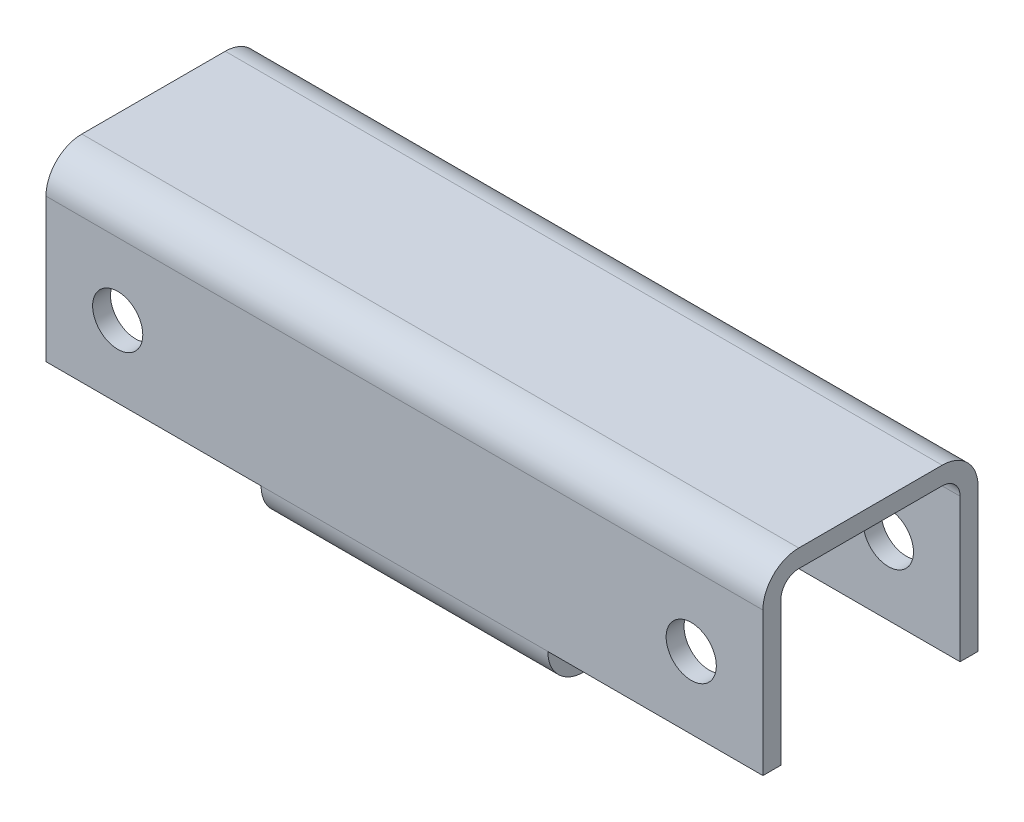
ISO-10303-21;
HEADER;
FILE_DESCRIPTION(('STEP AP214'),'2;1');
FILE_NAME('part.step','',(''),(''),'','','');
FILE_SCHEMA(('AUTOMOTIVE_DESIGN { 1 0 10303 214 1 1 1 1 }'));
ENDSEC;
DATA;
#1=APPLICATION_CONTEXT('core data for automotive mechanical design processes');
#2=APPLICATION_PROTOCOL_DEFINITION('international standard','automotive_design',2000,#1);
#3=PRODUCT_CONTEXT('',#1,'mechanical');
#4=PRODUCT('Part','Part','',(#3));
#5=PRODUCT_RELATED_PRODUCT_CATEGORY('part','',(#4));
#6=PRODUCT_DEFINITION_FORMATION('','',#4);
#7=PRODUCT_DEFINITION_CONTEXT('part definition',#1,'design');
#8=PRODUCT_DEFINITION('design','',#6,#7);
#9=PRODUCT_DEFINITION_SHAPE('','',#8);
#10=(LENGTH_UNIT() NAMED_UNIT(*) SI_UNIT(.MILLI.,.METRE.));
#11=(NAMED_UNIT(*) PLANE_ANGLE_UNIT() SI_UNIT($,.RADIAN.));
#12=(NAMED_UNIT(*) SI_UNIT($,.STERADIAN.) SOLID_ANGLE_UNIT());
#13=UNCERTAINTY_MEASURE_WITH_UNIT(LENGTH_MEASURE(1.E-05),#10,'distance_accuracy_value','');
#14=(GEOMETRIC_REPRESENTATION_CONTEXT(3) GLOBAL_UNCERTAINTY_ASSIGNED_CONTEXT((#13)) GLOBAL_UNIT_ASSIGNED_CONTEXT((#10,
#11,#12)) REPRESENTATION_CONTEXT('',''));
#15=CARTESIAN_POINT('',(0.,0.,0.));
#16=DIRECTION('',(0.,0.,1.));
#17=DIRECTION('',(1.,0.,0.));
#18=AXIS2_PLACEMENT_3D('',#15,#16,#17);
#19=CARTESIAN_POINT('',(-100.,20.,20.0000000000001));
#20=DIRECTION('',(1.,0.,0.));
#21=DIRECTION('',(0.,0.,-1.));
#22=AXIS2_PLACEMENT_3D('',#19,#20,#21);
#23=PLANE('',#22);
#24=DIRECTION('',(0.,0.,-1.));
#25=VECTOR('',#24,1.);
#26=CARTESIAN_POINT('',(-100.,-20.,20.));
#27=LINE('',#26,#25);
#28=CARTESIAN_POINT('',(-100.,-19.9999999999996,30.));
#29=VERTEX_POINT('',#28);
#30=CARTESIAN_POINT('',(-100.,-19.9999999999996,24.9999999999999));
#31=VERTEX_POINT('',#30);
#32=EDGE_CURVE('E219',#29,#31,#27,.T.);
#33=ORIENTED_EDGE('',*,*,#32,.F.);
#34=DIRECTION('',(0.,-1.,0.));
#35=VECTOR('',#34,1.);
#36=CARTESIAN_POINT('',(-100.,20.0000000000004,30.0000000000001));
#37=LINE('',#36,#35);
#38=CARTESIAN_POINT('',(-100.,20.0000000000004,30.0000000000001));
#39=VERTEX_POINT('',#38);
#40=EDGE_CURVE('E194',#39,#29,#37,.T.);
#41=ORIENTED_EDGE('',*,*,#40,.F.);
#42=CARTESIAN_POINT('',(-100.,20.,20.0000000000001));
#43=DIRECTION('',(1.,0.,0.));
#44=DIRECTION('',(0.,0.,-1.));
#45=AXIS2_PLACEMENT_3D('',#42,#43,#44);
#46=CIRCLE('',#45,9.99999999999999);
#47=CARTESIAN_POINT('',(-100.,30.,20.0000000000001));
#48=VERTEX_POINT('',#47);
#49=EDGE_CURVE('E191',#48,#39,#46,.T.);
#50=ORIENTED_EDGE('',*,*,#49,.F.);
#51=DIRECTION('',(0.,0.,1.));
#52=VECTOR('',#51,1.);
#53=CARTESIAN_POINT('',(-100.,30.,20.0000000000001));
#54=LINE('',#53,#52);
#55=CARTESIAN_POINT('',(-100.,29.9999999999997,-20.));
#56=VERTEX_POINT('',#55);
#57=EDGE_CURVE('E118',#56,#48,#54,.T.);
#58=ORIENTED_EDGE('',*,*,#57,.F.);
#59=CARTESIAN_POINT('',(-100.,19.9999999999997,-20.));
#60=DIRECTION('',(1.,0.,0.));
#61=DIRECTION('',(0.,0.,-1.));
#62=AXIS2_PLACEMENT_3D('',#59,#60,#61);
#63=CIRCLE('',#62,9.99999999999999);
#64=CARTESIAN_POINT('',(-100.,19.9999999999997,-30.));
#65=VERTEX_POINT('',#64);
#66=EDGE_CURVE('E112',#65,#56,#63,.T.);
#67=ORIENTED_EDGE('',*,*,#66,.F.);
#68=DIRECTION('',(0.,1.,0.));
#69=VECTOR('',#68,1.);
#70=CARTESIAN_POINT('',(-100.,-20.0000000000004,-30.0000000000001));
#71=LINE('',#70,#69);
#72=CARTESIAN_POINT('',(-100.,-20.0000000000004,-30.0000000000001));
#73=VERTEX_POINT('',#72);
#74=EDGE_CURVE('E165',#73,#65,#71,.T.);
#75=ORIENTED_EDGE('',*,*,#74,.F.);
#76=DIRECTION('',(0.,0.,1.));
#77=VECTOR('',#76,1.);
#78=CARTESIAN_POINT('',(-100.,-19.9999999999996,30.));
#79=LINE('',#78,#77);
#80=CARTESIAN_POINT('',(-100.,-20.0000000000004,-25.0000000000002));
#81=VERTEX_POINT('',#80);
#82=EDGE_CURVE('E306',#73,#81,#79,.T.);
#83=ORIENTED_EDGE('',*,*,#82,.T.);
#84=DIRECTION('',(0.,1.,0.));
#85=VECTOR('',#84,1.);
#86=CARTESIAN_POINT('',(-100.,-20.0000000000004,-25.0000000000002));
#87=LINE('',#86,#85);
#88=CARTESIAN_POINT('',(-100.,19.9999999999997,-24.9999999999999));
#89=VERTEX_POINT('',#88);
#90=EDGE_CURVE('E188',#81,#89,#87,.T.);
#91=ORIENTED_EDGE('',*,*,#90,.T.);
#92=CARTESIAN_POINT('',(-100.,19.9999999999997,-20.));
#93=DIRECTION('',(1.,0.,0.));
#94=DIRECTION('',(0.,0.,-1.));
#95=AXIS2_PLACEMENT_3D('',#92,#93,#94);
#96=CIRCLE('',#95,4.99999999999999);
#97=CARTESIAN_POINT('',(-100.,24.9999999999997,-20.));
#98=VERTEX_POINT('',#97);
#99=EDGE_CURVE('E185',#89,#98,#96,.T.);
#100=ORIENTED_EDGE('',*,*,#99,.T.);
#101=DIRECTION('',(0.,0.,1.));
#102=VECTOR('',#101,1.);
#103=CARTESIAN_POINT('',(-100.,24.9999999999999,20.0000000000001));
#104=LINE('',#103,#102);
#105=CARTESIAN_POINT('',(-100.,24.9999999999999,20.0000000000001));
#106=VERTEX_POINT('',#105);
#107=EDGE_CURVE('E182',#98,#106,#104,.T.);
#108=ORIENTED_EDGE('',*,*,#107,.T.);
#109=CARTESIAN_POINT('',(-100.,20.,20.0000000000001));
#110=DIRECTION('',(1.,0.,0.));
#111=DIRECTION('',(0.,0.,-1.));
#112=AXIS2_PLACEMENT_3D('',#109,#110,#111);
#113=CIRCLE('',#112,5.);
#114=CARTESIAN_POINT('',(-100.,20.0000000000004,25.));
#115=VERTEX_POINT('',#114);
#116=EDGE_CURVE('E178',#106,#115,#113,.T.);
#117=ORIENTED_EDGE('',*,*,#116,.T.);
#118=DIRECTION('',(0.,-1.,0.));
#119=VECTOR('',#118,1.);
#120=CARTESIAN_POINT('',(-100.,20.0000000000004,25.));
#121=LINE('',#120,#119);
#122=EDGE_CURVE('E175',#115,#31,#121,.T.);
#123=ORIENTED_EDGE('',*,*,#122,.T.);
#124=EDGE_LOOP('',(#33,#41,#50,#58,#67,#75,#83,#91,#100,#108,#117,#123));
#125=FACE_BOUND('',#124,.T.);
#126=ADVANCED_FACE('F62',(#125),#23,.F.);
#127=CARTESIAN_POINT('',(99.9999999999996,20.0000000000005,20.));
#128=DIRECTION('',(-1.,0.,0.));
#129=DIRECTION('',(0.,0.,1.));
#130=AXIS2_PLACEMENT_3D('',#127,#128,#129);
#131=CYLINDRICAL_SURFACE('',#130,9.99999999999999);
#132=ORIENTED_EDGE('',*,*,#49,.T.);
#133=DIRECTION('',(-1.,0.,0.));
#134=VECTOR('',#133,1.);
#135=CARTESIAN_POINT('',(99.9999999999996,20.0000000000005,30.));
#136=LINE('',#135,#134);
#137=CARTESIAN_POINT('',(99.9999999999996,20.0000000000005,30.));
#138=VERTEX_POINT('',#137);
#139=EDGE_CURVE('E216',#138,#39,#136,.T.);
#140=ORIENTED_EDGE('',*,*,#139,.F.);
#141=CARTESIAN_POINT('',(99.9999999999996,20.0000000000005,20.));
#142=DIRECTION('',(1.,0.,0.));
#143=DIRECTION('',(0.,0.,-1.));
#144=AXIS2_PLACEMENT_3D('',#141,#142,#143);
#145=CIRCLE('',#144,9.99999999999999);
#146=CARTESIAN_POINT('',(99.9999999999998,30.0000000000004,20.));
#147=VERTEX_POINT('',#146);
#148=EDGE_CURVE('E258',#147,#138,#145,.T.);
#149=ORIENTED_EDGE('',*,*,#148,.F.);
#150=DIRECTION('',(-1.,0.,0.));
#151=VECTOR('',#150,1.);
#152=CARTESIAN_POINT('',(99.9999999999998,30.0000000000004,20.));
#153=LINE('',#152,#151);
#154=EDGE_CURVE('E201',#147,#48,#153,.T.);
#155=ORIENTED_EDGE('',*,*,#154,.T.);
#156=EDGE_LOOP('',(#132,#140,#149,#155));
#157=FACE_BOUND('',#156,.T.);
#158=ADVANCED_FACE('F402',(#157),#131,.T.);
#159=CARTESIAN_POINT('',(99.9999999999996,20.0000000000005,30.));
#160=DIRECTION('',(0.,0.,-1.));
#161=DIRECTION('',(-1.,0.,0.));
#162=AXIS2_PLACEMENT_3D('',#159,#160,#161);
#163=PLANE('',#162);
#164=CARTESIAN_POINT('',(-80.,4.44089209850063E-13,30.));
#165=DIRECTION('',(0.,0.,1.));
#166=DIRECTION('',(1.,0.,0.));
#167=AXIS2_PLACEMENT_3D('',#164,#165,#166);
#168=CIRCLE('',#167,6.99999999999999);
#169=CARTESIAN_POINT('',(-73.,4.42584285660853E-13,30.));
#170=VERTEX_POINT('',#169);
#171=EDGE_CURVE('E471',#170,#170,#168,.T.);
#172=ORIENTED_EDGE('',*,*,#171,.F.);
#173=EDGE_LOOP('',(#172));
#174=FACE_BOUND('',#173,.T.);
#175=CARTESIAN_POINT('',(79.9999999999997,-3.2612801348364E-13,30.));
#176=DIRECTION('',(0.,0.,1.));
#177=DIRECTION('',(1.,0.,0.));
#178=AXIS2_PLACEMENT_3D('',#175,#176,#177);
#179=CIRCLE('',#178,6.99999999999999);
#180=CARTESIAN_POINT('',(86.9999999999997,-3.2763293767285E-13,30.));
#181=VERTEX_POINT('',#180);
#182=EDGE_CURVE('E483',#181,#181,#179,.T.);
#183=ORIENTED_EDGE('',*,*,#182,.F.);
#184=EDGE_LOOP('',(#183));
#185=FACE_BOUND('',#184,.T.);
#186=ORIENTED_EDGE('',*,*,#40,.T.);
#187=DIRECTION('',(-1.,0.,0.));
#188=VECTOR('',#187,1.);
#189=CARTESIAN_POINT('',(-40.0000000000001,-20.0000000000002,30.));
#190=LINE('',#189,#188);
#191=CARTESIAN_POINT('',(-40.0000000000001,-20.0000000000002,30.));
#192=VERTEX_POINT('',#191);
#193=EDGE_CURVE('E267',#192,#29,#190,.T.);
#194=ORIENTED_EDGE('',*,*,#193,.F.);
#195=DIRECTION('',(-1.,0.,0.));
#196=VECTOR('',#195,1.);
#197=CARTESIAN_POINT('',(99.9999999999999,-19.9999999999996,29.9999999999999));
#198=LINE('',#197,#196);
#199=CARTESIAN_POINT('',(39.9999999999998,-19.9999999999996,30.));
#200=VERTEX_POINT('',#199);
#201=EDGE_CURVE('E212',#200,#192,#198,.T.);
#202=ORIENTED_EDGE('',*,*,#201,.F.);
#203=CARTESIAN_POINT('',(99.9999999999999,-19.9999999999996,29.9999999999999));
#204=VERTEX_POINT('',#203);
#205=EDGE_CURVE('E213',#204,#200,#198,.T.);
#206=ORIENTED_EDGE('',*,*,#205,.F.);
#207=DIRECTION('',(0.,-1.,0.));
#208=VECTOR('',#207,1.);
#209=CARTESIAN_POINT('',(99.9999999999996,20.0000000000005,30.));
#210=LINE('',#209,#208);
#211=EDGE_CURVE('E159',#138,#204,#210,.T.);
#212=ORIENTED_EDGE('',*,*,#211,.F.);
#213=ORIENTED_EDGE('',*,*,#139,.T.);
#214=EDGE_LOOP('',(#186,#194,#202,#206,#212,#213));
#215=FACE_BOUND('',#214,.T.);
#216=ADVANCED_FACE('F262',(#174,#185,#215),#163,.F.);
#217=CARTESIAN_POINT('',(99.9999999999999,-19.9999999999996,19.9999999999999));
#218=DIRECTION('',(-1.,0.,0.));
#219=DIRECTION('',(0.,0.,1.));
#220=AXIS2_PLACEMENT_3D('',#217,#218,#219);
#221=CYLINDRICAL_SURFACE('',#220,9.99999999999999);
#222=DIRECTION('',(-1.,0.,0.));
#223=VECTOR('',#222,1.);
#224=CARTESIAN_POINT('',(99.9999999999998,-29.9999999999996,19.9999999999999));
#225=LINE('',#224,#223);
#226=CARTESIAN_POINT('',(39.9999999999998,-29.9999999999996,20.));
#227=VERTEX_POINT('',#226);
#228=CARTESIAN_POINT('',(-40.,-30.0000000000002,20.));
#229=VERTEX_POINT('',#228);
#230=EDGE_CURVE('E209',#227,#229,#225,.T.);
#231=ORIENTED_EDGE('',*,*,#230,.F.);
#232=CARTESIAN_POINT('',(39.9999999999998,-19.9999999999996,20.));
#233=DIRECTION('',(-1.,0.,0.));
#234=DIRECTION('',(0.,0.,1.));
#235=AXIS2_PLACEMENT_3D('',#232,#233,#234);
#236=CIRCLE('',#235,9.99999999999999);
#237=EDGE_CURVE('E278',#227,#200,#236,.T.);
#238=ORIENTED_EDGE('',*,*,#237,.T.);
#239=ORIENTED_EDGE('',*,*,#201,.T.);
#240=CARTESIAN_POINT('',(-40.0000000000001,-20.0000000000002,20.));
#241=DIRECTION('',(1.,0.,0.));
#242=DIRECTION('',(0.,0.,-1.));
#243=AXIS2_PLACEMENT_3D('',#240,#241,#242);
#244=CIRCLE('',#243,9.99999999999999);
#245=EDGE_CURVE('E179',#192,#229,#244,.T.);
#246=ORIENTED_EDGE('',*,*,#245,.T.);
#247=EDGE_LOOP('',(#231,#238,#239,#246));
#248=FACE_BOUND('',#247,.T.);
#249=ADVANCED_FACE('F275',(#248),#221,.T.);
#250=CARTESIAN_POINT('',(100.,-30.,-20.0000000000001));
#251=DIRECTION('',(0.,1.,0.));
#252=DIRECTION('',(0.,0.,1.));
#253=AXIS2_PLACEMENT_3D('',#250,#251,#252);
#254=PLANE('',#253);
#255=DIRECTION('',(-1.,0.,0.));
#256=VECTOR('',#255,1.);
#257=CARTESIAN_POINT('',(100.,-30.,-20.0000000000001));
#258=LINE('',#257,#256);
#259=CARTESIAN_POINT('',(40.,-29.9999999999996,-20.0000000000001));
#260=VERTEX_POINT('',#259);
#261=CARTESIAN_POINT('',(-40.,-30.0000000000002,-20.0000000000001));
#262=VERTEX_POINT('',#261);
#263=EDGE_CURVE('E206',#260,#262,#258,.T.);
#264=ORIENTED_EDGE('',*,*,#263,.F.);
#265=DIRECTION('',(0.,0.,-1.));
#266=VECTOR('',#265,1.);
#267=CARTESIAN_POINT('',(39.9999999999998,-29.9999999999996,30.));
#268=LINE('',#267,#266);
#269=EDGE_CURVE('E447',#227,#260,#268,.T.);
#270=ORIENTED_EDGE('',*,*,#269,.F.);
#271=ORIENTED_EDGE('',*,*,#230,.T.);
#272=DIRECTION('',(0.,0.,-1.));
#273=VECTOR('',#272,1.);
#274=CARTESIAN_POINT('',(-40.,-30.0000000000002,30.));
#275=LINE('',#274,#273);
#276=EDGE_CURVE('E293',#229,#262,#275,.T.);
#277=ORIENTED_EDGE('',*,*,#276,.T.);
#278=EDGE_LOOP('',(#264,#270,#271,#277));
#279=FACE_BOUND('',#278,.T.);
#280=ADVANCED_FACE('F461',(#279),#254,.F.);
#281=CARTESIAN_POINT('',(100.,-20.,-20.0000000000001));
#282=DIRECTION('',(-1.,0.,0.));
#283=DIRECTION('',(0.,0.,1.));
#284=AXIS2_PLACEMENT_3D('',#281,#282,#283);
#285=CYLINDRICAL_SURFACE('',#284,9.99999999999999);
#286=DIRECTION('',(-1.,0.,0.));
#287=VECTOR('',#286,1.);
#288=CARTESIAN_POINT('',(100.,-20.0000000000002,-30.0000000000001));
#289=LINE('',#288,#287);
#290=CARTESIAN_POINT('',(40.,-19.9999999999996,-30.0000000000001));
#291=VERTEX_POINT('',#290);
#292=CARTESIAN_POINT('',(-40.0000000000001,-20.0000000000004,-30.0000000000001));
#293=VERTEX_POINT('',#292);
#294=EDGE_CURVE('E166',#291,#293,#289,.T.);
#295=ORIENTED_EDGE('',*,*,#294,.F.);
#296=CARTESIAN_POINT('',(40.,-19.9999999999996,-20.0000000000001));
#297=DIRECTION('',(-1.,0.,0.));
#298=DIRECTION('',(0.,0.,1.));
#299=AXIS2_PLACEMENT_3D('',#296,#297,#298);
#300=CIRCLE('',#299,9.99999999999999);
#301=EDGE_CURVE('E450',#291,#260,#300,.T.);
#302=ORIENTED_EDGE('',*,*,#301,.T.);
#303=ORIENTED_EDGE('',*,*,#263,.T.);
#304=CARTESIAN_POINT('',(-40.0000000000001,-20.0000000000004,-20.0000000000001));
#305=DIRECTION('',(1.,0.,0.));
#306=DIRECTION('',(0.,0.,-1.));
#307=AXIS2_PLACEMENT_3D('',#304,#305,#306);
#308=CIRCLE('',#307,9.99999999999999);
#309=EDGE_CURVE('E294',#262,#293,#308,.T.);
#310=ORIENTED_EDGE('',*,*,#309,.T.);
#311=EDGE_LOOP('',(#295,#302,#303,#310));
#312=FACE_BOUND('',#311,.T.);
#313=ADVANCED_FACE('F458',(#312),#285,.T.);
#314=CARTESIAN_POINT('',(100.,-20.0000000000002,-30.0000000000001));
#315=DIRECTION('',(0.,0.,1.));
#316=DIRECTION('',(1.,0.,0.));
#317=AXIS2_PLACEMENT_3D('',#314,#315,#316);
#318=PLANE('',#317);
#319=CARTESIAN_POINT('',(-80.,4.44089209850063E-13,-30.));
#320=DIRECTION('',(0.,0.,1.));
#321=DIRECTION('',(1.,0.,0.));
#322=AXIS2_PLACEMENT_3D('',#319,#320,#321);
#323=CIRCLE('',#322,6.99999999999999);
#324=CARTESIAN_POINT('',(-73.,4.42584285660853E-13,-30.));
#325=VERTEX_POINT('',#324);
#326=EDGE_CURVE('E474',#325,#325,#323,.T.);
#327=ORIENTED_EDGE('',*,*,#326,.T.);
#328=EDGE_LOOP('',(#327));
#329=FACE_BOUND('',#328,.T.);
#330=CARTESIAN_POINT('',(80.,-3.2612801348364E-13,-30.));
#331=DIRECTION('',(0.,0.,1.));
#332=DIRECTION('',(1.,0.,0.));
#333=AXIS2_PLACEMENT_3D('',#330,#331,#332);
#334=CIRCLE('',#333,6.99999999999999);
#335=CARTESIAN_POINT('',(87.,-3.2763293767285E-13,-30.));
#336=VERTEX_POINT('',#335);
#337=EDGE_CURVE('E247',#336,#336,#334,.T.);
#338=ORIENTED_EDGE('',*,*,#337,.T.);
#339=EDGE_LOOP('',(#338));
#340=FACE_BOUND('',#339,.T.);
#341=ORIENTED_EDGE('',*,*,#74,.T.);
#342=DIRECTION('',(-1.,0.,0.));
#343=VECTOR('',#342,1.);
#344=CARTESIAN_POINT('',(100.,19.9999999999997,-30.));
#345=LINE('',#344,#343);
#346=CARTESIAN_POINT('',(100.,19.9999999999997,-30.));
#347=VERTEX_POINT('',#346);
#348=EDGE_CURVE('E161',#347,#65,#345,.T.);
#349=ORIENTED_EDGE('',*,*,#348,.F.);
#350=DIRECTION('',(0.,1.,0.));
#351=VECTOR('',#350,1.);
#352=CARTESIAN_POINT('',(100.,-20.0000000000002,-30.0000000000001));
#353=LINE('',#352,#351);
#354=CARTESIAN_POINT('',(100.,-20.0000000000002,-30.0000000000001));
#355=VERTEX_POINT('',#354);
#356=EDGE_CURVE('E148',#355,#347,#353,.T.);
#357=ORIENTED_EDGE('',*,*,#356,.F.);
#358=EDGE_CURVE('E204',#355,#291,#289,.T.);
#359=ORIENTED_EDGE('',*,*,#358,.T.);
#360=ORIENTED_EDGE('',*,*,#294,.T.);
#361=DIRECTION('',(-1.,0.,0.));
#362=VECTOR('',#361,1.);
#363=CARTESIAN_POINT('',(-40.0000000000001,-20.0000000000004,-30.0000000000001));
#364=LINE('',#363,#362);
#365=EDGE_CURVE('E313',#293,#73,#364,.T.);
#366=ORIENTED_EDGE('',*,*,#365,.T.);
#367=EDGE_LOOP('',(#341,#349,#357,#359,#360,#366));
#368=FACE_BOUND('',#367,.T.);
#369=ADVANCED_FACE('F162',(#329,#340,#368),#318,.F.);
#370=CARTESIAN_POINT('',(100.,20.,-20.));
#371=DIRECTION('',(-1.,0.,0.));
#372=DIRECTION('',(0.,0.,1.));
#373=AXIS2_PLACEMENT_3D('',#370,#371,#372);
#374=CYLINDRICAL_SURFACE('',#373,9.99999999999999);
#375=ORIENTED_EDGE('',*,*,#66,.T.);
#376=DIRECTION('',(-1.,0.,0.));
#377=VECTOR('',#376,1.);
#378=CARTESIAN_POINT('',(99.9999999999999,30.,-20.));
#379=LINE('',#378,#377);
#380=CARTESIAN_POINT('',(99.9999999999999,30.,-20.));
#381=VERTEX_POINT('',#380);
#382=EDGE_CURVE('E167',#381,#56,#379,.T.);
#383=ORIENTED_EDGE('',*,*,#382,.F.);
#384=CARTESIAN_POINT('',(100.,20.,-20.));
#385=DIRECTION('',(1.,0.,0.));
#386=DIRECTION('',(0.,0.,-1.));
#387=AXIS2_PLACEMENT_3D('',#384,#385,#386);
#388=CIRCLE('',#387,9.99999999999999);
#389=EDGE_CURVE('E152',#347,#381,#388,.T.);
#390=ORIENTED_EDGE('',*,*,#389,.F.);
#391=ORIENTED_EDGE('',*,*,#348,.T.);
#392=EDGE_LOOP('',(#375,#383,#390,#391));
#393=FACE_BOUND('',#392,.T.);
#394=ADVANCED_FACE('F169',(#393),#374,.T.);
#395=CARTESIAN_POINT('',(99.9999999999999,-19.9999999999996,19.9999999999999));
#396=DIRECTION('',(-1.,0.,0.));
#397=DIRECTION('',(0.,0.,1.));
#398=AXIS2_PLACEMENT_3D('',#395,#396,#397);
#399=CYLINDRICAL_SURFACE('',#398,5.);
#400=CARTESIAN_POINT('',(39.9999999999998,-19.9999999999996,20.));
#401=DIRECTION('',(-1.,0.,0.));
#402=DIRECTION('',(0.,0.,1.));
#403=AXIS2_PLACEMENT_3D('',#400,#401,#402);
#404=CIRCLE('',#403,5.);
#405=CARTESIAN_POINT('',(39.9999999999999,-24.9999999999996,20.));
#406=VERTEX_POINT('',#405);
#407=CARTESIAN_POINT('',(39.9999999999998,-19.9999999999996,24.9999999999999));
#408=VERTEX_POINT('',#407);
#409=EDGE_CURVE('E459',#406,#408,#404,.T.);
#410=ORIENTED_EDGE('',*,*,#409,.F.);
#411=DIRECTION('',(-1.,0.,0.));
#412=VECTOR('',#411,1.);
#413=CARTESIAN_POINT('',(99.9999999999998,-24.9999999999996,19.9999999999999));
#414=LINE('',#413,#412);
#415=CARTESIAN_POINT('',(-40.0000000000002,-25.0000000000002,20.));
#416=VERTEX_POINT('',#415);
#417=EDGE_CURVE('E171',#406,#416,#414,.T.);
#418=ORIENTED_EDGE('',*,*,#417,.T.);
#419=CARTESIAN_POINT('',(-40.0000000000001,-20.0000000000002,20.));
#420=DIRECTION('',(1.,0.,0.));
#421=DIRECTION('',(0.,0.,-1.));
#422=AXIS2_PLACEMENT_3D('',#419,#420,#421);
#423=CIRCLE('',#422,5.);
#424=CARTESIAN_POINT('',(-40.0000000000001,-20.0000000000002,24.9999999999999));
#425=VERTEX_POINT('',#424);
#426=EDGE_CURVE('E322',#425,#416,#423,.T.);
#427=ORIENTED_EDGE('',*,*,#426,.F.);
#428=DIRECTION('',(-1.,0.,0.));
#429=VECTOR('',#428,1.);
#430=CARTESIAN_POINT('',(99.9999999999999,-19.9999999999996,24.9999999999998));
#431=LINE('',#430,#429);
#432=EDGE_CURVE('E237',#408,#425,#431,.T.);
#433=ORIENTED_EDGE('',*,*,#432,.F.);
#434=EDGE_LOOP('',(#410,#418,#427,#433));
#435=FACE_BOUND('',#434,.T.);
#436=ADVANCED_FACE('F64',(#435),#399,.F.);
#437=CARTESIAN_POINT('',(99.9999999999996,20.0000000000005,25.0000000000001));
#438=DIRECTION('',(0.,0.,-1.));
#439=DIRECTION('',(-1.,0.,0.));
#440=AXIS2_PLACEMENT_3D('',#437,#438,#439);
#441=PLANE('',#440);
#442=CARTESIAN_POINT('',(-80.,4.44089209850063E-13,24.9999999999999));
#443=DIRECTION('',(0.,0.,-1.));
#444=DIRECTION('',(-1.,0.,0.));
#445=AXIS2_PLACEMENT_3D('',#442,#443,#444);
#446=CIRCLE('',#445,6.99999999999999);
#447=CARTESIAN_POINT('',(-87.,4.45594134039273E-13,24.9999999999999));
#448=VERTEX_POINT('',#447);
#449=EDGE_CURVE('E480',#448,#448,#446,.T.);
#450=ORIENTED_EDGE('',*,*,#449,.F.);
#451=EDGE_LOOP('',(#450));
#452=FACE_BOUND('',#451,.T.);
#453=CARTESIAN_POINT('',(79.9999999999997,-3.2612801348364E-13,25.0000000000001));
#454=DIRECTION('',(0.,0.,-1.));
#455=DIRECTION('',(-1.,0.,0.));
#456=AXIS2_PLACEMENT_3D('',#453,#454,#455);
#457=CIRCLE('',#456,6.99999999999999);
#458=CARTESIAN_POINT('',(72.9999999999997,-3.2462308929443E-13,25.0000000000001));
#459=VERTEX_POINT('',#458);
#460=EDGE_CURVE('E246',#459,#459,#457,.T.);
#461=ORIENTED_EDGE('',*,*,#460,.F.);
#462=EDGE_LOOP('',(#461));
#463=FACE_BOUND('',#462,.T.);
#464=ORIENTED_EDGE('',*,*,#122,.F.);
#465=DIRECTION('',(-1.,0.,0.));
#466=VECTOR('',#465,1.);
#467=CARTESIAN_POINT('',(99.9999999999996,20.0000000000005,25.0000000000001));
#468=LINE('',#467,#466);
#469=CARTESIAN_POINT('',(99.9999999999996,20.0000000000005,25.0000000000001));
#470=VERTEX_POINT('',#469);
#471=EDGE_CURVE('E235',#470,#115,#468,.T.);
#472=ORIENTED_EDGE('',*,*,#471,.F.);
#473=DIRECTION('',(0.,-1.,0.));
#474=VECTOR('',#473,1.);
#475=CARTESIAN_POINT('',(99.9999999999996,20.0000000000005,25.0000000000001));
#476=LINE('',#475,#474);
#477=CARTESIAN_POINT('',(99.9999999999999,-19.9999999999996,24.9999999999998));
#478=VERTEX_POINT('',#477);
#479=EDGE_CURVE('E200',#470,#478,#476,.T.);
#480=ORIENTED_EDGE('',*,*,#479,.T.);
#481=EDGE_CURVE('E127',#478,#408,#431,.T.);
#482=ORIENTED_EDGE('',*,*,#481,.T.);
#483=ORIENTED_EDGE('',*,*,#432,.T.);
#484=DIRECTION('',(-1.,0.,0.));
#485=VECTOR('',#484,1.);
#486=CARTESIAN_POINT('',(99.9999999999999,-19.9999999999996,24.9999999999998));
#487=LINE('',#486,#485);
#488=EDGE_CURVE('E302',#425,#31,#487,.T.);
#489=ORIENTED_EDGE('',*,*,#488,.T.);
#490=EDGE_LOOP('',(#464,#472,#480,#482,#483,#489));
#491=FACE_BOUND('',#490,.T.);
#492=ADVANCED_FACE('F492',(#452,#463,#491),#441,.T.);
#493=CARTESIAN_POINT('',(99.9999999999996,20.0000000000005,20.));
#494=DIRECTION('',(-1.,0.,0.));
#495=DIRECTION('',(0.,0.,1.));
#496=AXIS2_PLACEMENT_3D('',#493,#494,#495);
#497=CYLINDRICAL_SURFACE('',#496,5.);
#498=ORIENTED_EDGE('',*,*,#116,.F.);
#499=DIRECTION('',(-1.,0.,0.));
#500=VECTOR('',#499,1.);
#501=CARTESIAN_POINT('',(99.9999999999998,25.0000000000004,20.));
#502=LINE('',#501,#500);
#503=CARTESIAN_POINT('',(99.9999999999998,25.0000000000004,20.));
#504=VERTEX_POINT('',#503);
#505=EDGE_CURVE('E233',#504,#106,#502,.T.);
#506=ORIENTED_EDGE('',*,*,#505,.F.);
#507=CARTESIAN_POINT('',(99.9999999999996,20.0000000000005,20.));
#508=DIRECTION('',(1.,0.,0.));
#509=DIRECTION('',(0.,0.,-1.));
#510=AXIS2_PLACEMENT_3D('',#507,#508,#509);
#511=CIRCLE('',#510,5.);
#512=EDGE_CURVE('E327',#504,#470,#511,.T.);
#513=ORIENTED_EDGE('',*,*,#512,.T.);
#514=ORIENTED_EDGE('',*,*,#471,.T.);
#515=EDGE_LOOP('',(#498,#506,#513,#514));
#516=FACE_BOUND('',#515,.T.);
#517=ADVANCED_FACE('F495',(#516),#497,.F.);
#518=CARTESIAN_POINT('',(99.9999999999998,25.0000000000004,20.));
#519=DIRECTION('',(0.,-1.,0.));
#520=DIRECTION('',(0.,0.,-1.));
#521=AXIS2_PLACEMENT_3D('',#518,#519,#520);
#522=PLANE('',#521);
#523=ORIENTED_EDGE('',*,*,#107,.F.);
#524=DIRECTION('',(-1.,0.,0.));
#525=VECTOR('',#524,1.);
#526=CARTESIAN_POINT('',(100.,24.9999999999999,-20.));
#527=LINE('',#526,#525);
#528=CARTESIAN_POINT('',(100.,24.9999999999999,-20.));
#529=VERTEX_POINT('',#528);
#530=EDGE_CURVE('E231',#529,#98,#527,.T.);
#531=ORIENTED_EDGE('',*,*,#530,.F.);
#532=DIRECTION('',(0.,0.,1.));
#533=VECTOR('',#532,1.);
#534=CARTESIAN_POINT('',(99.9999999999998,25.0000000000004,20.));
#535=LINE('',#534,#533);
#536=EDGE_CURVE('E330',#529,#504,#535,.T.);
#537=ORIENTED_EDGE('',*,*,#536,.T.);
#538=ORIENTED_EDGE('',*,*,#505,.T.);
#539=EDGE_LOOP('',(#523,#531,#537,#538));
#540=FACE_BOUND('',#539,.T.);
#541=ADVANCED_FACE('F503',(#540),#522,.T.);
#542=CARTESIAN_POINT('',(100.,20.,-20.));
#543=DIRECTION('',(-1.,0.,0.));
#544=DIRECTION('',(0.,0.,1.));
#545=AXIS2_PLACEMENT_3D('',#542,#543,#544);
#546=CYLINDRICAL_SURFACE('',#545,4.99999999999999);
#547=ORIENTED_EDGE('',*,*,#99,.F.);
#548=DIRECTION('',(-1.,0.,0.));
#549=VECTOR('',#548,1.);
#550=CARTESIAN_POINT('',(100.,19.9999999999997,-24.9999999999999));
#551=LINE('',#550,#549);
#552=CARTESIAN_POINT('',(100.,19.9999999999997,-24.9999999999999));
#553=VERTEX_POINT('',#552);
#554=EDGE_CURVE('E229',#553,#89,#551,.T.);
#555=ORIENTED_EDGE('',*,*,#554,.F.);
#556=CARTESIAN_POINT('',(100.,20.,-20.));
#557=DIRECTION('',(1.,0.,0.));
#558=DIRECTION('',(0.,0.,-1.));
#559=AXIS2_PLACEMENT_3D('',#556,#557,#558);
#560=CIRCLE('',#559,4.99999999999999);
#561=EDGE_CURVE('E333',#553,#529,#560,.T.);
#562=ORIENTED_EDGE('',*,*,#561,.T.);
#563=ORIENTED_EDGE('',*,*,#530,.T.);
#564=EDGE_LOOP('',(#547,#555,#562,#563));
#565=FACE_BOUND('',#564,.T.);
#566=ADVANCED_FACE('F505',(#565),#546,.F.);
#567=CARTESIAN_POINT('',(100.,-20.0000000000002,-25.));
#568=DIRECTION('',(0.,0.,1.));
#569=DIRECTION('',(0.,-1.,0.));
#570=AXIS2_PLACEMENT_3D('',#567,#568,#569);
#571=PLANE('',#570);
#572=CARTESIAN_POINT('',(-80.,4.44089209850063E-13,-25.0000000000001));
#573=DIRECTION('',(0.,0.,1.));
#574=DIRECTION('',(0.,-1.,0.));
#575=AXIS2_PLACEMENT_3D('',#572,#573,#574);
#576=CIRCLE('',#575,6.99999999999999);
#577=CARTESIAN_POINT('',(-80.,-6.99999999999955,-25.0000000000002));
#578=VERTEX_POINT('',#577);
#579=EDGE_CURVE('E477',#578,#578,#576,.T.);
#580=ORIENTED_EDGE('',*,*,#579,.F.);
#581=EDGE_LOOP('',(#580));
#582=FACE_BOUND('',#581,.T.);
#583=CARTESIAN_POINT('',(80.,-3.2612801348364E-13,-24.9999999999999));
#584=DIRECTION('',(0.,0.,1.));
#585=DIRECTION('',(0.,-1.,0.));
#586=AXIS2_PLACEMENT_3D('',#583,#584,#585);
#587=CIRCLE('',#586,6.99999999999999);
#588=CARTESIAN_POINT('',(80.,-7.00000000000032,-24.9999999999999));
#589=VERTEX_POINT('',#588);
#590=EDGE_CURVE('E244',#589,#589,#587,.T.);
#591=ORIENTED_EDGE('',*,*,#590,.F.);
#592=EDGE_LOOP('',(#591));
#593=FACE_BOUND('',#592,.T.);
#594=ORIENTED_EDGE('',*,*,#90,.F.);
#595=DIRECTION('',(-1.,0.,0.));
#596=VECTOR('',#595,1.);
#597=CARTESIAN_POINT('',(100.,-20.0000000000002,-25.));
#598=LINE('',#597,#596);
#599=CARTESIAN_POINT('',(-40.0000000000001,-20.0000000000004,-25.));
#600=VERTEX_POINT('',#599);
#601=EDGE_CURVE('E315',#81,#600,#598,.F.);
#602=ORIENTED_EDGE('',*,*,#601,.T.);
#603=DIRECTION('',(-1.,0.,0.));
#604=VECTOR('',#603,1.);
#605=CARTESIAN_POINT('',(100.,-20.0000000000002,-25.));
#606=LINE('',#605,#604);
#607=CARTESIAN_POINT('',(40.,-19.9999999999996,-25.));
#608=VERTEX_POINT('',#607);
#609=EDGE_CURVE('E225',#608,#600,#606,.T.);
#610=ORIENTED_EDGE('',*,*,#609,.F.);
#611=CARTESIAN_POINT('',(100.,-20.0000000000002,-25.));
#612=VERTEX_POINT('',#611);
#613=EDGE_CURVE('E226',#612,#608,#606,.T.);
#614=ORIENTED_EDGE('',*,*,#613,.F.);
#615=DIRECTION('',(0.,1.,0.));
#616=VECTOR('',#615,1.);
#617=CARTESIAN_POINT('',(100.,-20.0000000000002,-25.));
#618=LINE('',#617,#616);
#619=EDGE_CURVE('E336',#612,#553,#618,.T.);
#620=ORIENTED_EDGE('',*,*,#619,.T.);
#621=ORIENTED_EDGE('',*,*,#554,.T.);
#622=EDGE_LOOP('',(#594,#602,#610,#614,#620,#621));
#623=FACE_BOUND('',#622,.T.);
#624=ADVANCED_FACE('F342',(#582,#593,#623),#571,.T.);
#625=CARTESIAN_POINT('',(100.,-20.,-20.0000000000001));
#626=DIRECTION('',(-1.,0.,0.));
#627=DIRECTION('',(0.,0.,1.));
#628=AXIS2_PLACEMENT_3D('',#625,#626,#627);
#629=CYLINDRICAL_SURFACE('',#628,5.);
#630=CARTESIAN_POINT('',(40.,-19.9999999999996,-20.0000000000001));
#631=DIRECTION('',(-1.,0.,0.));
#632=DIRECTION('',(0.,0.,1.));
#633=AXIS2_PLACEMENT_3D('',#630,#631,#632);
#634=CIRCLE('',#633,5.);
#635=CARTESIAN_POINT('',(40.,-24.9999999999996,-20.0000000000001));
#636=VERTEX_POINT('',#635);
#637=EDGE_CURVE('E395',#608,#636,#634,.T.);
#638=ORIENTED_EDGE('',*,*,#637,.F.);
#639=ORIENTED_EDGE('',*,*,#609,.T.);
#640=CARTESIAN_POINT('',(-40.0000000000001,-20.0000000000004,-20.0000000000001));
#641=DIRECTION('',(1.,0.,0.));
#642=DIRECTION('',(0.,0.,-1.));
#643=AXIS2_PLACEMENT_3D('',#640,#641,#642);
#644=CIRCLE('',#643,5.);
#645=CARTESIAN_POINT('',(-40.0000000000002,-25.0000000000004,-20.0000000000001));
#646=VERTEX_POINT('',#645);
#647=EDGE_CURVE('E319',#646,#600,#644,.T.);
#648=ORIENTED_EDGE('',*,*,#647,.F.);
#649=DIRECTION('',(-1.,0.,0.));
#650=VECTOR('',#649,1.);
#651=CARTESIAN_POINT('',(100.,-24.9999999999999,-20.0000000000001));
#652=LINE('',#651,#650);
#653=EDGE_CURVE('E222',#636,#646,#652,.T.);
#654=ORIENTED_EDGE('',*,*,#653,.F.);
#655=EDGE_LOOP('',(#638,#639,#648,#654));
#656=FACE_BOUND('',#655,.T.);
#657=ADVANCED_FACE('F394',(#656),#629,.F.);
#658=CARTESIAN_POINT('',(100.,-24.9999999999999,-20.0000000000001));
#659=DIRECTION('',(0.,1.,0.));
#660=DIRECTION('',(0.,0.,1.));
#661=AXIS2_PLACEMENT_3D('',#658,#659,#660);
#662=PLANE('',#661);
#663=DIRECTION('',(0.,0.,1.));
#664=VECTOR('',#663,1.);
#665=CARTESIAN_POINT('',(40.,-24.9999999999996,-20.0000000000001));
#666=LINE('',#665,#664);
#667=EDGE_CURVE('E12',#636,#406,#666,.T.);
#668=ORIENTED_EDGE('',*,*,#667,.F.);
#669=ORIENTED_EDGE('',*,*,#653,.T.);
#670=DIRECTION('',(0.,0.,-1.));
#671=VECTOR('',#670,1.);
#672=CARTESIAN_POINT('',(-40.0000000000002,-25.0000000000004,-20.0000000000001));
#673=LINE('',#672,#671);
#674=EDGE_CURVE('E241',#416,#646,#673,.T.);
#675=ORIENTED_EDGE('',*,*,#674,.F.);
#676=ORIENTED_EDGE('',*,*,#417,.F.);
#677=EDGE_LOOP('',(#668,#669,#675,#676));
#678=FACE_BOUND('',#677,.T.);
#679=ADVANCED_FACE('F389',(#678),#662,.T.);
#680=CARTESIAN_POINT('',(99.9999999999998,30.0000000000004,20.));
#681=DIRECTION('',(0.,-1.,0.));
#682=DIRECTION('',(0.,0.,-1.));
#683=AXIS2_PLACEMENT_3D('',#680,#681,#682);
#684=PLANE('',#683);
#685=ORIENTED_EDGE('',*,*,#57,.T.);
#686=ORIENTED_EDGE('',*,*,#154,.F.);
#687=DIRECTION('',(0.,0.,1.));
#688=VECTOR('',#687,1.);
#689=CARTESIAN_POINT('',(99.9999999999998,30.0000000000004,20.));
#690=LINE('',#689,#688);
#691=EDGE_CURVE('E79',#381,#147,#690,.T.);
#692=ORIENTED_EDGE('',*,*,#691,.F.);
#693=ORIENTED_EDGE('',*,*,#382,.T.);
#694=EDGE_LOOP('',(#685,#686,#692,#693));
#695=FACE_BOUND('',#694,.T.);
#696=ADVANCED_FACE('F403',(#695),#684,.F.);
#697=CARTESIAN_POINT('',(99.9999999999996,20.0000000000005,20.));
#698=DIRECTION('',(1.,0.,0.));
#699=DIRECTION('',(0.,0.,-1.));
#700=AXIS2_PLACEMENT_3D('',#697,#698,#699);
#701=PLANE('',#700);
#702=DIRECTION('',(0.,0.,1.));
#703=VECTOR('',#702,1.);
#704=CARTESIAN_POINT('',(99.9999999999999,-19.9999999999996,29.9999999999999));
#705=LINE('',#704,#703);
#706=EDGE_CURVE('E156',#355,#612,#705,.T.);
#707=ORIENTED_EDGE('',*,*,#706,.F.);
#708=ORIENTED_EDGE('',*,*,#356,.T.);
#709=ORIENTED_EDGE('',*,*,#389,.T.);
#710=ORIENTED_EDGE('',*,*,#691,.T.);
#711=ORIENTED_EDGE('',*,*,#148,.T.);
#712=ORIENTED_EDGE('',*,*,#211,.T.);
#713=DIRECTION('',(0.,0.,1.));
#714=VECTOR('',#713,1.);
#715=CARTESIAN_POINT('',(99.9999999999999,-19.9999999999996,19.9999999999999));
#716=LINE('',#715,#714);
#717=EDGE_CURVE('E71',#478,#204,#716,.T.);
#718=ORIENTED_EDGE('',*,*,#717,.F.);
#719=ORIENTED_EDGE('',*,*,#479,.F.);
#720=ORIENTED_EDGE('',*,*,#512,.F.);
#721=ORIENTED_EDGE('',*,*,#536,.F.);
#722=ORIENTED_EDGE('',*,*,#561,.F.);
#723=ORIENTED_EDGE('',*,*,#619,.F.);
#724=EDGE_LOOP('',(#707,#708,#709,#710,#711,#712,#718,#719,#720,#721,#722,#723));
#725=FACE_BOUND('',#724,.T.);
#726=ADVANCED_FACE('F150',(#725),#701,.T.);
#727=CARTESIAN_POINT('',(-40.,-3.2612801348364E-13,0.));
#728=DIRECTION('',(1.,0.,0.));
#729=DIRECTION('',(0.,0.,-1.));
#730=AXIS2_PLACEMENT_3D('',#727,#728,#729);
#731=PLANE('',#730);
#732=DIRECTION('',(0.,0.,1.));
#733=VECTOR('',#732,1.);
#734=CARTESIAN_POINT('',(-40.0000000000001,-20.0000000000002,30.));
#735=LINE('',#734,#733);
#736=EDGE_CURVE('E289',#425,#192,#735,.T.);
#737=ORIENTED_EDGE('',*,*,#736,.F.);
#738=ORIENTED_EDGE('',*,*,#426,.T.);
#739=ORIENTED_EDGE('',*,*,#674,.T.);
#740=ORIENTED_EDGE('',*,*,#647,.T.);
#741=EDGE_CURVE('E303',#293,#600,#735,.T.);
#742=ORIENTED_EDGE('',*,*,#741,.F.);
#743=ORIENTED_EDGE('',*,*,#309,.F.);
#744=ORIENTED_EDGE('',*,*,#276,.F.);
#745=ORIENTED_EDGE('',*,*,#245,.F.);
#746=EDGE_LOOP('',(#737,#738,#739,#740,#742,#743,#744,#745));
#747=FACE_BOUND('',#746,.T.);
#748=ADVANCED_FACE('F286',(#747),#731,.F.);
#749=CARTESIAN_POINT('',(-40.0000000000001,-20.0000000000002,30.));
#750=DIRECTION('',(0.,-1.,0.));
#751=DIRECTION('',(0.,0.,-1.));
#752=AXIS2_PLACEMENT_3D('',#749,#750,#751);
#753=PLANE('',#752);
#754=ORIENTED_EDGE('',*,*,#736,.T.);
#755=ORIENTED_EDGE('',*,*,#193,.T.);
#756=ORIENTED_EDGE('',*,*,#32,.T.);
#757=ORIENTED_EDGE('',*,*,#488,.F.);
#758=EDGE_LOOP('',(#754,#755,#756,#757));
#759=FACE_BOUND('',#758,.T.);
#760=ADVANCED_FACE('F298',(#759),#753,.T.);
#761=ORIENTED_EDGE('',*,*,#82,.F.);
#762=ORIENTED_EDGE('',*,*,#365,.F.);
#763=ORIENTED_EDGE('',*,*,#741,.T.);
#764=ORIENTED_EDGE('',*,*,#601,.F.);
#765=EDGE_LOOP('',(#761,#762,#763,#764));
#766=FACE_BOUND('',#765,.T.);
#767=ADVANCED_FACE('F397',(#766),#753,.T.);
#768=CARTESIAN_POINT('',(79.9999999999997,-3.2612801348364E-13,30.));
#769=DIRECTION('',(0.,0.,1.));
#770=DIRECTION('',(1.,0.,0.));
#771=AXIS2_PLACEMENT_3D('',#768,#769,#770);
#772=CYLINDRICAL_SURFACE('',#771,6.99999999999999);
#773=ORIENTED_EDGE('',*,*,#590,.T.);
#774=EDGE_LOOP('',(#773));
#775=FACE_BOUND('',#774,.T.);
#776=ORIENTED_EDGE('',*,*,#337,.F.);
#777=EDGE_LOOP('',(#776));
#778=FACE_BOUND('',#777,.T.);
#779=ADVANCED_FACE('F422',(#775,#778),#772,.F.);
#780=ORIENTED_EDGE('',*,*,#460,.T.);
#781=EDGE_LOOP('',(#780));
#782=FACE_BOUND('',#781,.T.);
#783=ORIENTED_EDGE('',*,*,#182,.T.);
#784=EDGE_LOOP('',(#783));
#785=FACE_BOUND('',#784,.T.);
#786=ADVANCED_FACE('F427',(#782,#785),#772,.F.);
#787=CARTESIAN_POINT('',(-80.,4.44089209850063E-13,30.));
#788=DIRECTION('',(0.,0.,1.));
#789=DIRECTION('',(1.,0.,0.));
#790=AXIS2_PLACEMENT_3D('',#787,#788,#789);
#791=CYLINDRICAL_SURFACE('',#790,6.99999999999999);
#792=ORIENTED_EDGE('',*,*,#579,.T.);
#793=EDGE_LOOP('',(#792));
#794=FACE_BOUND('',#793,.T.);
#795=ORIENTED_EDGE('',*,*,#326,.F.);
#796=EDGE_LOOP('',(#795));
#797=FACE_BOUND('',#796,.T.);
#798=ADVANCED_FACE('F429',(#794,#797),#791,.F.);
#799=ORIENTED_EDGE('',*,*,#449,.T.);
#800=EDGE_LOOP('',(#799));
#801=FACE_BOUND('',#800,.T.);
#802=ORIENTED_EDGE('',*,*,#171,.T.);
#803=EDGE_LOOP('',(#802));
#804=FACE_BOUND('',#803,.T.);
#805=ADVANCED_FACE('F432',(#801,#804),#791,.F.);
#806=CARTESIAN_POINT('',(39.9999999999997,4.44089209850063E-13,0.));
#807=DIRECTION('',(-1.,0.,0.));
#808=DIRECTION('',(0.,0.,-1.));
#809=AXIS2_PLACEMENT_3D('',#806,#807,#808);
#810=PLANE('',#809);
#811=ORIENTED_EDGE('',*,*,#269,.T.);
#812=ORIENTED_EDGE('',*,*,#301,.F.);
#813=DIRECTION('',(0.,0.,1.));
#814=VECTOR('',#813,1.);
#815=CARTESIAN_POINT('',(39.9999999999998,-19.9999999999996,30.));
#816=LINE('',#815,#814);
#817=EDGE_CURVE('E454',#291,#608,#816,.T.);
#818=ORIENTED_EDGE('',*,*,#817,.T.);
#819=ORIENTED_EDGE('',*,*,#637,.T.);
#820=ORIENTED_EDGE('',*,*,#667,.T.);
#821=ORIENTED_EDGE('',*,*,#409,.T.);
#822=EDGE_CURVE('E464',#408,#200,#816,.T.);
#823=ORIENTED_EDGE('',*,*,#822,.T.);
#824=ORIENTED_EDGE('',*,*,#237,.F.);
#825=EDGE_LOOP('',(#811,#812,#818,#819,#820,#821,#823,#824));
#826=FACE_BOUND('',#825,.T.);
#827=ADVANCED_FACE('F437',(#826),#810,.F.);
#828=CARTESIAN_POINT('',(39.9999999999998,-19.9999999999996,30.));
#829=DIRECTION('',(0.,1.,0.));
#830=DIRECTION('',(0.,0.,1.));
#831=AXIS2_PLACEMENT_3D('',#828,#829,#830);
#832=PLANE('',#831);
#833=ORIENTED_EDGE('',*,*,#481,.F.);
#834=ORIENTED_EDGE('',*,*,#717,.T.);
#835=ORIENTED_EDGE('',*,*,#205,.T.);
#836=ORIENTED_EDGE('',*,*,#822,.F.);
#837=EDGE_LOOP('',(#833,#834,#835,#836));
#838=FACE_BOUND('',#837,.T.);
#839=ADVANCED_FACE('F250',(#838),#832,.F.);
#840=ORIENTED_EDGE('',*,*,#613,.T.);
#841=ORIENTED_EDGE('',*,*,#817,.F.);
#842=ORIENTED_EDGE('',*,*,#358,.F.);
#843=ORIENTED_EDGE('',*,*,#706,.T.);
#844=EDGE_LOOP('',(#840,#841,#842,#843));
#845=FACE_BOUND('',#844,.T.);
#846=ADVANCED_FACE('F434',(#845),#832,.F.);
#847=CLOSED_SHELL('',(#126,#158,#216,#249,#280,#313,#369,#394,#436,#492,#517,#541,#566,#624,
#657,#679,#696,#726,#748,#760,#767,#779,#786,#798,#805,#827,#839,#846));
#848=MANIFOLD_SOLID_BREP('B2',#847);
#849=ADVANCED_BREP_SHAPE_REPRESENTATION('',(#18,#848),#14);
#850=SHAPE_DEFINITION_REPRESENTATION(#9,#849);
ENDSEC;
END-ISO-10303-21;
